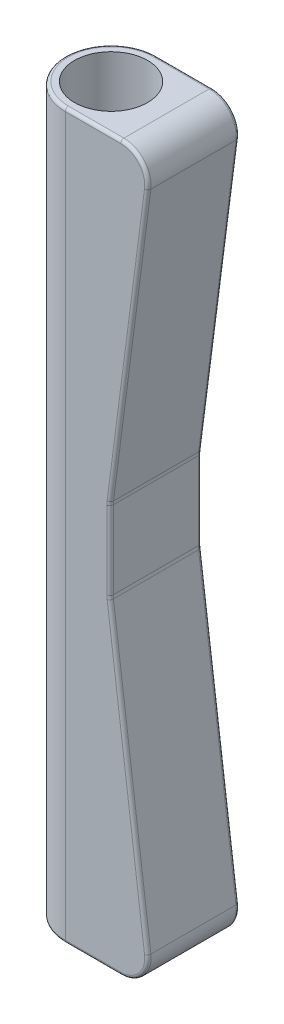
ISO-10303-21;
HEADER;
FILE_DESCRIPTION(('STEP AP214'),'2;1');
FILE_NAME('part.step','',(''),(''),'','','');
FILE_SCHEMA(('AUTOMOTIVE_DESIGN { 1 0 10303 214 1 1 1 1 }'));
ENDSEC;
DATA;
#1=APPLICATION_CONTEXT('core data for automotive mechanical design processes');
#2=APPLICATION_PROTOCOL_DEFINITION('international standard','automotive_design',2000,#1);
#3=PRODUCT_CONTEXT('',#1,'mechanical');
#4=PRODUCT('Part','Part','',(#3));
#5=PRODUCT_RELATED_PRODUCT_CATEGORY('part','',(#4));
#6=PRODUCT_DEFINITION_FORMATION('','',#4);
#7=PRODUCT_DEFINITION_CONTEXT('part definition',#1,'design');
#8=PRODUCT_DEFINITION('design','',#6,#7);
#9=PRODUCT_DEFINITION_SHAPE('','',#8);
#10=(LENGTH_UNIT() NAMED_UNIT(*) SI_UNIT(.MILLI.,.METRE.));
#11=(NAMED_UNIT(*) PLANE_ANGLE_UNIT() SI_UNIT($,.RADIAN.));
#12=(NAMED_UNIT(*) SI_UNIT($,.STERADIAN.) SOLID_ANGLE_UNIT());
#13=UNCERTAINTY_MEASURE_WITH_UNIT(LENGTH_MEASURE(1.E-05),#10,'distance_accuracy_value','');
#14=(GEOMETRIC_REPRESENTATION_CONTEXT(3) GLOBAL_UNCERTAINTY_ASSIGNED_CONTEXT((#13)) GLOBAL_UNIT_ASSIGNED_CONTEXT((#10,
#11,#12)) REPRESENTATION_CONTEXT('',''));
#15=CARTESIAN_POINT('',(0.,0.,0.));
#16=DIRECTION('',(0.,0.,1.));
#17=DIRECTION('',(1.,0.,0.));
#18=AXIS2_PLACEMENT_3D('',#15,#16,#17);
#19=CARTESIAN_POINT('',(0.,226.06,0.));
#20=DIRECTION('',(0.,-1.,0.));
#21=DIRECTION('',(0.,0.,-1.));
#22=AXIS2_PLACEMENT_3D('',#19,#20,#21);
#23=CYLINDRICAL_SURFACE('',#22,14.2875);
#24=DIRECTION('',(0.,1.,0.));
#25=VECTOR('',#24,1.);
#26=CARTESIAN_POINT('',(0.,0.,14.2875));
#27=LINE('',#26,#25);
#28=CARTESIAN_POINT('',(0.,1.,14.2875));
#29=VERTEX_POINT('',#28);
#30=CARTESIAN_POINT('',(0.,225.06,14.2875));
#31=VERTEX_POINT('',#30);
#32=EDGE_CURVE('E181',#29,#31,#27,.T.);
#33=ORIENTED_EDGE('',*,*,#32,.T.);
#34=CARTESIAN_POINT('',(0.,225.06,0.));
#35=DIRECTION('',(0.,1.,0.));
#36=DIRECTION('',(0.,0.,1.));
#37=AXIS2_PLACEMENT_3D('',#34,#35,#36);
#38=CIRCLE('',#37,14.2875);
#39=CARTESIAN_POINT('',(0.,225.06,-14.2875));
#40=VERTEX_POINT('',#39);
#41=EDGE_CURVE('E190',#31,#40,#38,.F.);
#42=ORIENTED_EDGE('',*,*,#41,.T.);
#43=DIRECTION('',(0.,1.,0.));
#44=VECTOR('',#43,1.);
#45=CARTESIAN_POINT('',(0.,0.,-14.2875));
#46=LINE('',#45,#44);
#47=CARTESIAN_POINT('',(0.,0.999999999999996,-14.2875));
#48=VERTEX_POINT('',#47);
#49=EDGE_CURVE('E184',#48,#40,#46,.T.);
#50=ORIENTED_EDGE('',*,*,#49,.F.);
#51=CARTESIAN_POINT('',(0.,1.,0.));
#52=DIRECTION('',(0.,1.,0.));
#53=DIRECTION('',(0.,0.,1.));
#54=AXIS2_PLACEMENT_3D('',#51,#52,#53);
#55=CIRCLE('',#54,14.2875);
#56=EDGE_CURVE('E179',#48,#29,#55,.T.);
#57=ORIENTED_EDGE('',*,*,#56,.T.);
#58=EDGE_LOOP('',(#33,#42,#50,#57));
#59=FACE_BOUND('',#58,.T.);
#60=ADVANCED_FACE('F41',(#59),#23,.T.);
#61=CARTESIAN_POINT('',(0.,226.06,0.));
#62=DIRECTION('',(0.,1.,0.));
#63=DIRECTION('',(0.,0.,1.));
#64=AXIS2_PLACEMENT_3D('',#61,#62,#63);
#65=PLANE('',#64);
#66=CARTESIAN_POINT('',(0.,226.06,0.));
#67=DIRECTION('',(0.,1.,0.));
#68=DIRECTION('',(0.,0.,1.));
#69=AXIS2_PLACEMENT_3D('',#66,#67,#68);
#70=CIRCLE('',#69,13.2875);
#71=CARTESIAN_POINT('',(0.,226.06,-13.2875));
#72=VERTEX_POINT('',#71);
#73=CARTESIAN_POINT('',(0.,226.06,13.2875));
#74=VERTEX_POINT('',#73);
#75=EDGE_CURVE('E239',#72,#74,#70,.T.);
#76=ORIENTED_EDGE('',*,*,#75,.T.);
#77=DIRECTION('',(1.,0.,0.));
#78=VECTOR('',#77,1.);
#79=CARTESIAN_POINT('',(0.,226.06,13.2875));
#80=LINE('',#79,#78);
#81=CARTESIAN_POINT('',(17.3150782146866,226.06,13.2875));
#82=VERTEX_POINT('',#81);
#83=EDGE_CURVE('E191',#74,#82,#80,.T.);
#84=ORIENTED_EDGE('',*,*,#83,.T.);
#85=DIRECTION('',(0.,0.,-1.));
#86=VECTOR('',#85,1.);
#87=CARTESIAN_POINT('',(17.3150782146866,226.06,-14.2875));
#88=LINE('',#87,#86);
#89=CARTESIAN_POINT('',(17.3150782146866,226.06,-13.2875));
#90=VERTEX_POINT('',#89);
#91=EDGE_CURVE('E404',#82,#90,#88,.T.);
#92=ORIENTED_EDGE('',*,*,#91,.T.);
#93=DIRECTION('',(-1.,0.,0.));
#94=VECTOR('',#93,1.);
#95=CARTESIAN_POINT('',(0.,226.06,-13.2875));
#96=LINE('',#95,#94);
#97=EDGE_CURVE('E236',#90,#72,#96,.T.);
#98=ORIENTED_EDGE('',*,*,#97,.T.);
#99=EDGE_LOOP('',(#76,#84,#92,#98));
#100=FACE_BOUND('',#99,.T.);
#101=CARTESIAN_POINT('',(0.,226.06,0.));
#102=DIRECTION('',(0.,1.,0.));
#103=DIRECTION('',(0.,0.,1.));
#104=AXIS2_PLACEMENT_3D('',#101,#102,#103);
#105=CIRCLE('',#104,11.4125);
#106=CARTESIAN_POINT('',(0.,226.06,11.4125));
#107=VERTEX_POINT('',#106);
#108=EDGE_CURVE('E390',#107,#107,#105,.T.);
#109=ORIENTED_EDGE('',*,*,#108,.F.);
#110=EDGE_LOOP('',(#109));
#111=FACE_BOUND('',#110,.T.);
#112=ADVANCED_FACE('F532',(#100,#111),#65,.T.);
#113=CARTESIAN_POINT('',(0.,0.,0.));
#114=DIRECTION('',(0.,1.,0.));
#115=DIRECTION('',(0.,0.,1.));
#116=AXIS2_PLACEMENT_3D('',#113,#114,#115);
#117=PLANE('',#116);
#118=CARTESIAN_POINT('',(0.,0.,0.));
#119=DIRECTION('',(0.,1.,0.));
#120=DIRECTION('',(0.,0.,1.));
#121=AXIS2_PLACEMENT_3D('',#118,#119,#120);
#122=CIRCLE('',#121,13.2875);
#123=CARTESIAN_POINT('',(0.,0.,13.2875));
#124=VERTEX_POINT('',#123);
#125=CARTESIAN_POINT('',(0.,0.,-13.2875));
#126=VERTEX_POINT('',#125);
#127=EDGE_CURVE('E51',#124,#126,#122,.F.);
#128=ORIENTED_EDGE('',*,*,#127,.T.);
#129=DIRECTION('',(-1.,0.,0.));
#130=VECTOR('',#129,1.);
#131=CARTESIAN_POINT('',(17.3150782146866,0.,-13.2875));
#132=LINE('',#131,#130);
#133=CARTESIAN_POINT('',(17.3150782146866,0.,-13.2875));
#134=VERTEX_POINT('',#133);
#135=EDGE_CURVE('E11',#126,#134,#132,.F.);
#136=ORIENTED_EDGE('',*,*,#135,.T.);
#137=DIRECTION('',(0.,0.,-1.));
#138=VECTOR('',#137,1.);
#139=CARTESIAN_POINT('',(17.3150782146866,0.,0.));
#140=LINE('',#139,#138);
#141=CARTESIAN_POINT('',(17.3150782146866,0.,13.2875));
#142=VERTEX_POINT('',#141);
#143=EDGE_CURVE('E401',#134,#142,#140,.F.);
#144=ORIENTED_EDGE('',*,*,#143,.T.);
#145=DIRECTION('',(1.,0.,0.));
#146=VECTOR('',#145,1.);
#147=CARTESIAN_POINT('',(0.,0.,13.2875));
#148=LINE('',#147,#146);
#149=EDGE_CURVE('E62',#142,#124,#148,.F.);
#150=ORIENTED_EDGE('',*,*,#149,.T.);
#151=EDGE_LOOP('',(#128,#136,#144,#150));
#152=FACE_BOUND('',#151,.T.);
#153=CARTESIAN_POINT('',(0.,0.,0.));
#154=DIRECTION('',(0.,1.,0.));
#155=DIRECTION('',(0.,0.,1.));
#156=AXIS2_PLACEMENT_3D('',#153,#154,#155);
#157=CIRCLE('',#156,11.4125);
#158=CARTESIAN_POINT('',(0.,0.,11.4125));
#159=VERTEX_POINT('',#158);
#160=EDGE_CURVE('E202',#159,#159,#157,.T.);
#161=ORIENTED_EDGE('',*,*,#160,.T.);
#162=EDGE_LOOP('',(#161));
#163=FACE_BOUND('',#162,.T.);
#164=ADVANCED_FACE('F515',(#152,#163),#117,.F.);
#165=CARTESIAN_POINT('',(0.,226.06,0.));
#166=DIRECTION('',(0.,-1.,0.));
#167=DIRECTION('',(0.,0.,-1.));
#168=AXIS2_PLACEMENT_3D('',#165,#166,#167);
#169=CYLINDRICAL_SURFACE('',#168,11.4125);
#170=ORIENTED_EDGE('',*,*,#108,.T.);
#171=EDGE_LOOP('',(#170));
#172=FACE_BOUND('',#171,.T.);
#173=ORIENTED_EDGE('',*,*,#160,.F.);
#174=EDGE_LOOP('',(#173));
#175=FACE_BOUND('',#174,.T.);
#176=ADVANCED_FACE('F768',(#172,#175),#169,.F.);
#177=CARTESIAN_POINT('',(14.2875,0.,14.2875));
#178=DIRECTION('',(0.,0.,1.));
#179=DIRECTION('',(1.,0.,0.));
#180=AXIS2_PLACEMENT_3D('',#177,#178,#179);
#181=PLANE('',#180);
#182=CARTESIAN_POINT('',(17.3150782146866,217.56,14.2875));
#183=DIRECTION('',(0.,0.,1.));
#184=DIRECTION('',(1.,0.,0.));
#185=AXIS2_PLACEMENT_3D('',#182,#183,#184);
#186=CIRCLE('',#185,7.5);
#187=CARTESIAN_POINT('',(24.7529012591629,216.596263335212,14.2875));
#188=VERTEX_POINT('',#187);
#189=CARTESIAN_POINT('',(17.3150782146866,225.06,14.2875));
#190=VERTEX_POINT('',#189);
#191=EDGE_CURVE('E217',#188,#190,#186,.T.);
#192=ORIENTED_EDGE('',*,*,#191,.T.);
#193=DIRECTION('',(1.,0.,0.));
#194=VECTOR('',#193,1.);
#195=CARTESIAN_POINT('',(14.2875,225.06,14.2875));
#196=LINE('',#195,#194);
#197=EDGE_CURVE('E200',#190,#31,#196,.F.);
#198=ORIENTED_EDGE('',*,*,#197,.T.);
#199=ORIENTED_EDGE('',*,*,#32,.F.);
#200=DIRECTION('',(1.,0.,0.));
#201=VECTOR('',#200,1.);
#202=CARTESIAN_POINT('',(17.3150782146866,1.,14.2875));
#203=LINE('',#202,#201);
#204=CARTESIAN_POINT('',(17.3150782146866,1.,14.2875));
#205=VERTEX_POINT('',#204);
#206=EDGE_CURVE('E197',#29,#205,#203,.T.);
#207=ORIENTED_EDGE('',*,*,#206,.T.);
#208=CARTESIAN_POINT('',(17.3150782146866,8.5,14.2875));
#209=DIRECTION('',(0.,0.,1.));
#210=DIRECTION('',(1.,0.,0.));
#211=AXIS2_PLACEMENT_3D('',#208,#209,#210);
#212=CIRCLE('',#211,7.5);
#213=CARTESIAN_POINT('',(24.7529012591629,9.46373666478812,14.2875));
#214=VERTEX_POINT('',#213);
#215=EDGE_CURVE('E218',#205,#214,#212,.T.);
#216=ORIENTED_EDGE('',*,*,#215,.T.);
#217=DIRECTION('',(0.128498221971749,-0.99170973926351,0.));
#218=VECTOR('',#217,1.);
#219=CARTESIAN_POINT('',(13.0662574769966,99.6576574851528,14.2875));
#220=LINE('',#219,#218);
#221=CARTESIAN_POINT('',(13.0662574769967,99.6576574851527,14.2875));
#222=VERTEX_POINT('',#221);
#223=EDGE_CURVE('E223',#214,#222,#220,.F.);
#224=ORIENTED_EDGE('',*,*,#223,.T.);
#225=CARTESIAN_POINT('',(22.4875,100.878390593884,14.2875));
#226=DIRECTION('',(0.,0.,1.));
#227=DIRECTION('',(1.,0.,0.));
#228=AXIS2_PLACEMENT_3D('',#225,#226,#227);
#229=CIRCLE('',#228,9.5);
#230=CARTESIAN_POINT('',(12.9875,100.878390593884,14.2875));
#231=VERTEX_POINT('',#230);
#232=EDGE_CURVE('E437',#222,#231,#229,.F.);
#233=ORIENTED_EDGE('',*,*,#232,.T.);
#234=DIRECTION('',(0.,-1.,0.));
#235=VECTOR('',#234,1.);
#236=CARTESIAN_POINT('',(12.9875,125.181609406116,14.2875));
#237=LINE('',#236,#235);
#238=CARTESIAN_POINT('',(12.9875,125.181609406116,14.2875));
#239=VERTEX_POINT('',#238);
#240=EDGE_CURVE('E434',#231,#239,#237,.F.);
#241=ORIENTED_EDGE('',*,*,#240,.T.);
#242=CARTESIAN_POINT('',(22.4875,125.181609406116,14.2875));
#243=DIRECTION('',(0.,0.,1.));
#244=DIRECTION('',(1.,0.,0.));
#245=AXIS2_PLACEMENT_3D('',#242,#243,#244);
#246=CIRCLE('',#245,9.5);
#247=CARTESIAN_POINT('',(13.0662574769967,126.402342514847,14.2875));
#248=VERTEX_POINT('',#247);
#249=EDGE_CURVE('E431',#239,#248,#246,.F.);
#250=ORIENTED_EDGE('',*,*,#249,.T.);
#251=DIRECTION('',(-0.12849822197175,-0.99170973926351,0.));
#252=VECTOR('',#251,1.);
#253=CARTESIAN_POINT('',(24.7529012591629,216.596263335212,14.2875));
#254=LINE('',#253,#252);
#255=EDGE_CURVE('E428',#248,#188,#254,.F.);
#256=ORIENTED_EDGE('',*,*,#255,.T.);
#257=EDGE_LOOP('',(#192,#198,#199,#207,#216,#224,#233,#241,#250,#256));
#258=FACE_BOUND('',#257,.T.);
#259=ADVANCED_FACE('F195',(#258),#181,.T.);
#260=CARTESIAN_POINT('',(14.2875,0.,-14.2875));
#261=DIRECTION('',(0.,0.,-1.));
#262=DIRECTION('',(-1.,0.,0.));
#263=AXIS2_PLACEMENT_3D('',#260,#261,#262);
#264=PLANE('',#263);
#265=ORIENTED_EDGE('',*,*,#49,.T.);
#266=DIRECTION('',(-1.,0.,0.));
#267=VECTOR('',#266,1.);
#268=CARTESIAN_POINT('',(14.2875,225.06,-14.2875));
#269=LINE('',#268,#267);
#270=CARTESIAN_POINT('',(17.3150782146866,225.06,-14.2875));
#271=VERTEX_POINT('',#270);
#272=EDGE_CURVE('E270',#40,#271,#269,.F.);
#273=ORIENTED_EDGE('',*,*,#272,.T.);
#274=CARTESIAN_POINT('',(17.3150782146866,217.56,-14.2875));
#275=DIRECTION('',(0.,0.,-1.));
#276=DIRECTION('',(-1.,0.,0.));
#277=AXIS2_PLACEMENT_3D('',#274,#275,#276);
#278=CIRCLE('',#277,7.5);
#279=CARTESIAN_POINT('',(24.7529012591629,216.596263335212,-14.2875));
#280=VERTEX_POINT('',#279);
#281=EDGE_CURVE('E267',#271,#280,#278,.T.);
#282=ORIENTED_EDGE('',*,*,#281,.T.);
#283=DIRECTION('',(-0.12849822197175,-0.99170973926351,0.));
#284=VECTOR('',#283,1.);
#285=CARTESIAN_POINT('',(13.0662574769967,126.402342514847,-14.2875));
#286=LINE('',#285,#284);
#287=CARTESIAN_POINT('',(13.0662574769967,126.402342514847,-14.2875));
#288=VERTEX_POINT('',#287);
#289=EDGE_CURVE('E264',#280,#288,#286,.T.);
#290=ORIENTED_EDGE('',*,*,#289,.T.);
#291=CARTESIAN_POINT('',(22.4875,125.181609406116,-14.2875));
#292=DIRECTION('',(0.,0.,-1.));
#293=DIRECTION('',(-1.,0.,0.));
#294=AXIS2_PLACEMENT_3D('',#291,#292,#293);
#295=CIRCLE('',#294,9.5);
#296=CARTESIAN_POINT('',(12.9875,125.181609406116,-14.2875));
#297=VERTEX_POINT('',#296);
#298=EDGE_CURVE('E261',#288,#297,#295,.F.);
#299=ORIENTED_EDGE('',*,*,#298,.T.);
#300=DIRECTION('',(0.,-1.,0.));
#301=VECTOR('',#300,1.);
#302=CARTESIAN_POINT('',(12.9875,100.878390593884,-14.2875));
#303=LINE('',#302,#301);
#304=CARTESIAN_POINT('',(12.9875,100.878390593884,-14.2875));
#305=VERTEX_POINT('',#304);
#306=EDGE_CURVE('E258',#297,#305,#303,.T.);
#307=ORIENTED_EDGE('',*,*,#306,.T.);
#308=CARTESIAN_POINT('',(22.4875,100.878390593884,-14.2875));
#309=DIRECTION('',(0.,0.,-1.));
#310=DIRECTION('',(-1.,0.,0.));
#311=AXIS2_PLACEMENT_3D('',#308,#309,#310);
#312=CIRCLE('',#311,9.5);
#313=CARTESIAN_POINT('',(13.0662574769966,99.6576574851527,-14.2875));
#314=VERTEX_POINT('',#313);
#315=EDGE_CURVE('E255',#305,#314,#312,.F.);
#316=ORIENTED_EDGE('',*,*,#315,.T.);
#317=DIRECTION('',(0.128498221971749,-0.99170973926351,0.));
#318=VECTOR('',#317,1.);
#319=CARTESIAN_POINT('',(24.7529012591629,9.46373666478812,-14.2875));
#320=LINE('',#319,#318);
#321=CARTESIAN_POINT('',(24.7529012591629,9.46373666478812,-14.2875));
#322=VERTEX_POINT('',#321);
#323=EDGE_CURVE('E252',#314,#322,#320,.T.);
#324=ORIENTED_EDGE('',*,*,#323,.T.);
#325=CARTESIAN_POINT('',(17.3150782146866,8.5,-14.2875));
#326=DIRECTION('',(0.,0.,-1.));
#327=DIRECTION('',(-1.,0.,0.));
#328=AXIS2_PLACEMENT_3D('',#325,#326,#327);
#329=CIRCLE('',#328,7.5);
#330=CARTESIAN_POINT('',(17.3150782146866,1.,-14.2875));
#331=VERTEX_POINT('',#330);
#332=EDGE_CURVE('E249',#322,#331,#329,.T.);
#333=ORIENTED_EDGE('',*,*,#332,.T.);
#334=DIRECTION('',(-1.,0.,0.));
#335=VECTOR('',#334,1.);
#336=CARTESIAN_POINT('',(0.,1.,-14.2875));
#337=LINE('',#336,#335);
#338=EDGE_CURVE('E246',#331,#48,#337,.T.);
#339=ORIENTED_EDGE('',*,*,#338,.T.);
#340=EDGE_LOOP('',(#265,#273,#282,#290,#299,#307,#316,#324,#333,#339));
#341=FACE_BOUND('',#340,.T.);
#342=ADVANCED_FACE('F484',(#341),#264,.T.);
#343=CARTESIAN_POINT('',(-2.26560202610545,0.29355951698765,-14.2875));
#344=DIRECTION('',(-0.99170973926351,0.12849822197175,0.));
#345=DIRECTION('',(-0.12849822197175,-0.99170973926351,0.));
#346=AXIS2_PLACEMENT_3D('',#343,#344,#345);
#347=PLANE('',#346);
#348=DIRECTION('',(0.,0.,1.));
#349=VECTOR('',#348,1.);
#350=CARTESIAN_POINT('',(14.0579672162602,126.273844292876,-14.2875));
#351=LINE('',#350,#349);
#352=CARTESIAN_POINT('',(14.0579672162602,126.273844292876,13.2875));
#353=VERTEX_POINT('',#352);
#354=CARTESIAN_POINT('',(14.0579672162602,126.273844292876,-13.2875));
#355=VERTEX_POINT('',#354);
#356=EDGE_CURVE('E424',#353,#355,#351,.F.);
#357=ORIENTED_EDGE('',*,*,#356,.T.);
#358=DIRECTION('',(-0.12849822197175,-0.99170973926351,0.));
#359=VECTOR('',#358,1.);
#360=CARTESIAN_POINT('',(25.7446109984264,216.46776511324,-13.2875));
#361=LINE('',#360,#359);
#362=CARTESIAN_POINT('',(25.7446109984264,216.46776511324,-13.2875));
#363=VERTEX_POINT('',#362);
#364=EDGE_CURVE('E276',#355,#363,#361,.F.);
#365=ORIENTED_EDGE('',*,*,#364,.T.);
#366=DIRECTION('',(0.,0.,-1.));
#367=VECTOR('',#366,1.);
#368=CARTESIAN_POINT('',(25.7446109984264,216.46776511324,14.2875));
#369=LINE('',#368,#367);
#370=CARTESIAN_POINT('',(25.7446109984264,216.46776511324,13.2875));
#371=VERTEX_POINT('',#370);
#372=EDGE_CURVE('E408',#363,#371,#369,.F.);
#373=ORIENTED_EDGE('',*,*,#372,.T.);
#374=DIRECTION('',(-0.12849822197175,-0.99170973926351,0.));
#375=VECTOR('',#374,1.);
#376=CARTESIAN_POINT('',(14.0579672162602,126.273844292876,13.2875));
#377=LINE('',#376,#375);
#378=EDGE_CURVE('E273',#371,#353,#377,.T.);
#379=ORIENTED_EDGE('',*,*,#378,.T.);
#380=EDGE_LOOP('',(#357,#365,#373,#379));
#381=FACE_BOUND('',#380,.T.);
#382=ADVANCED_FACE('F741',(#381),#347,.F.);
#383=CARTESIAN_POINT('',(26.5418879850658,3.43909641987297,-14.2875));
#384=DIRECTION('',(-0.99170973926351,-0.128498221971749,0.));
#385=DIRECTION('',(0.128498221971749,-0.99170973926351,0.));
#386=AXIS2_PLACEMENT_3D('',#383,#384,#385);
#387=PLANE('',#386);
#388=DIRECTION('',(0.,0.,-1.));
#389=VECTOR('',#388,1.);
#390=CARTESIAN_POINT('',(25.7446109984264,9.59223488675987,-14.2875));
#391=LINE('',#390,#389);
#392=CARTESIAN_POINT('',(25.7446109984264,9.59223488675987,13.2875));
#393=VERTEX_POINT('',#392);
#394=CARTESIAN_POINT('',(25.7446109984264,9.59223488675987,-13.2875));
#395=VERTEX_POINT('',#394);
#396=EDGE_CURVE('E394',#393,#395,#391,.T.);
#397=ORIENTED_EDGE('',*,*,#396,.T.);
#398=DIRECTION('',(0.128498221971749,-0.99170973926351,0.));
#399=VECTOR('',#398,1.);
#400=CARTESIAN_POINT('',(14.0579672162602,99.7861557071245,-13.2875));
#401=LINE('',#400,#399);
#402=CARTESIAN_POINT('',(14.0579672162602,99.7861557071245,-13.2875));
#403=VERTEX_POINT('',#402);
#404=EDGE_CURVE('E300',#395,#403,#401,.F.);
#405=ORIENTED_EDGE('',*,*,#404,.T.);
#406=DIRECTION('',(0.,0.,1.));
#407=VECTOR('',#406,1.);
#408=CARTESIAN_POINT('',(14.0579672162602,99.7861557071245,14.2875));
#409=LINE('',#408,#407);
#410=CARTESIAN_POINT('',(14.0579672162602,99.7861557071245,13.2875));
#411=VERTEX_POINT('',#410);
#412=EDGE_CURVE('E412',#403,#411,#409,.T.);
#413=ORIENTED_EDGE('',*,*,#412,.T.);
#414=DIRECTION('',(0.128498221971749,-0.99170973926351,0.));
#415=VECTOR('',#414,1.);
#416=CARTESIAN_POINT('',(25.7446109984264,9.59223488675987,13.2875));
#417=LINE('',#416,#415);
#418=EDGE_CURVE('E297',#411,#393,#417,.T.);
#419=ORIENTED_EDGE('',*,*,#418,.T.);
#420=EDGE_LOOP('',(#397,#405,#413,#419));
#421=FACE_BOUND('',#420,.T.);
#422=ADVANCED_FACE('F732',(#421),#387,.F.);
#423=CARTESIAN_POINT('',(13.9875,0.,-14.2875));
#424=DIRECTION('',(-1.,0.,0.));
#425=DIRECTION('',(0.,-1.,0.));
#426=AXIS2_PLACEMENT_3D('',#423,#424,#425);
#427=PLANE('',#426);
#428=DIRECTION('',(0.,0.,1.));
#429=VECTOR('',#428,1.);
#430=CARTESIAN_POINT('',(13.9875,100.878390593884,-14.2875));
#431=LINE('',#430,#429);
#432=CARTESIAN_POINT('',(13.9875,100.878390593884,13.2875));
#433=VERTEX_POINT('',#432);
#434=CARTESIAN_POINT('',(13.9875,100.878390593884,-13.2875));
#435=VERTEX_POINT('',#434);
#436=EDGE_CURVE('E420',#433,#435,#431,.F.);
#437=ORIENTED_EDGE('',*,*,#436,.T.);
#438=DIRECTION('',(0.,-1.,0.));
#439=VECTOR('',#438,1.);
#440=CARTESIAN_POINT('',(13.9875,125.181609406116,-13.2875));
#441=LINE('',#440,#439);
#442=CARTESIAN_POINT('',(13.9875,125.181609406116,-13.2875));
#443=VERTEX_POINT('',#442);
#444=EDGE_CURVE('E288',#435,#443,#441,.F.);
#445=ORIENTED_EDGE('',*,*,#444,.T.);
#446=DIRECTION('',(0.,0.,1.));
#447=VECTOR('',#446,1.);
#448=CARTESIAN_POINT('',(13.9875,125.181609406116,14.2875));
#449=LINE('',#448,#447);
#450=CARTESIAN_POINT('',(13.9875,125.181609406116,13.2875));
#451=VERTEX_POINT('',#450);
#452=EDGE_CURVE('E416',#443,#451,#449,.T.);
#453=ORIENTED_EDGE('',*,*,#452,.T.);
#454=DIRECTION('',(0.,-1.,0.));
#455=VECTOR('',#454,1.);
#456=CARTESIAN_POINT('',(13.9875,100.878390593884,13.2875));
#457=LINE('',#456,#455);
#458=EDGE_CURVE('E285',#451,#433,#457,.T.);
#459=ORIENTED_EDGE('',*,*,#458,.T.);
#460=EDGE_LOOP('',(#437,#445,#453,#459));
#461=FACE_BOUND('',#460,.T.);
#462=ADVANCED_FACE('F544',(#461),#427,.F.);
#463=CARTESIAN_POINT('',(17.3150782146866,8.5,-14.2875));
#464=DIRECTION('',(0.,0.,-1.));
#465=DIRECTION('',(-1.,0.,0.));
#466=AXIS2_PLACEMENT_3D('',#463,#464,#465);
#467=CYLINDRICAL_SURFACE('',#466,8.5);
#468=ORIENTED_EDGE('',*,*,#143,.F.);
#469=CARTESIAN_POINT('',(17.3150782146866,8.5,-13.2875));
#470=DIRECTION('',(0.,0.,-1.));
#471=DIRECTION('',(-1.,0.,0.));
#472=AXIS2_PLACEMENT_3D('',#469,#470,#471);
#473=CIRCLE('',#472,8.5);
#474=EDGE_CURVE('E306',#134,#395,#473,.F.);
#475=ORIENTED_EDGE('',*,*,#474,.T.);
#476=ORIENTED_EDGE('',*,*,#396,.F.);
#477=CARTESIAN_POINT('',(17.3150782146866,8.5,13.2875));
#478=DIRECTION('',(0.,0.,1.));
#479=DIRECTION('',(1.,0.,0.));
#480=AXIS2_PLACEMENT_3D('',#477,#478,#479);
#481=CIRCLE('',#480,8.5);
#482=EDGE_CURVE('E303',#393,#142,#481,.F.);
#483=ORIENTED_EDGE('',*,*,#482,.T.);
#484=EDGE_LOOP('',(#468,#475,#476,#483));
#485=FACE_BOUND('',#484,.T.);
#486=ADVANCED_FACE('F518',(#485),#467,.T.);
#487=CARTESIAN_POINT('',(17.3150782146866,217.56,0.));
#488=DIRECTION('',(0.,0.,1.));
#489=DIRECTION('',(1.,0.,0.));
#490=AXIS2_PLACEMENT_3D('',#487,#488,#489);
#491=CYLINDRICAL_SURFACE('',#490,8.5);
#492=ORIENTED_EDGE('',*,*,#91,.F.);
#493=CARTESIAN_POINT('',(17.3150782146866,217.56,13.2875));
#494=DIRECTION('',(0.,0.,1.));
#495=DIRECTION('',(1.,0.,0.));
#496=AXIS2_PLACEMENT_3D('',#493,#494,#495);
#497=CIRCLE('',#496,8.5);
#498=EDGE_CURVE('E232',#82,#371,#497,.F.);
#499=ORIENTED_EDGE('',*,*,#498,.T.);
#500=ORIENTED_EDGE('',*,*,#372,.F.);
#501=CARTESIAN_POINT('',(17.3150782146866,217.56,-13.2875));
#502=DIRECTION('',(0.,0.,-1.));
#503=DIRECTION('',(-1.,0.,0.));
#504=AXIS2_PLACEMENT_3D('',#501,#502,#503);
#505=CIRCLE('',#504,8.5);
#506=EDGE_CURVE('E229',#363,#90,#505,.F.);
#507=ORIENTED_EDGE('',*,*,#506,.T.);
#508=EDGE_LOOP('',(#492,#499,#500,#507));
#509=FACE_BOUND('',#508,.T.);
#510=ADVANCED_FACE('F543',(#509),#491,.T.);
#511=CARTESIAN_POINT('',(22.4875,100.878390593884,-14.2875));
#512=DIRECTION('',(0.,0.,-1.));
#513=DIRECTION('',(-1.,0.,0.));
#514=AXIS2_PLACEMENT_3D('',#511,#512,#513);
#515=CYLINDRICAL_SURFACE('',#514,8.5);
#516=ORIENTED_EDGE('',*,*,#412,.F.);
#517=CARTESIAN_POINT('',(22.4875,100.878390593884,-13.2875));
#518=DIRECTION('',(0.,0.,-1.));
#519=DIRECTION('',(-1.,0.,0.));
#520=AXIS2_PLACEMENT_3D('',#517,#518,#519);
#521=CIRCLE('',#520,8.5);
#522=EDGE_CURVE('E294',#403,#435,#521,.T.);
#523=ORIENTED_EDGE('',*,*,#522,.T.);
#524=ORIENTED_EDGE('',*,*,#436,.F.);
#525=CARTESIAN_POINT('',(22.4875,100.878390593884,13.2875));
#526=DIRECTION('',(0.,0.,1.));
#527=DIRECTION('',(1.,0.,0.));
#528=AXIS2_PLACEMENT_3D('',#525,#526,#527);
#529=CIRCLE('',#528,8.5);
#530=EDGE_CURVE('E291',#433,#411,#529,.T.);
#531=ORIENTED_EDGE('',*,*,#530,.T.);
#532=EDGE_LOOP('',(#516,#523,#524,#531));
#533=FACE_BOUND('',#532,.T.);
#534=ADVANCED_FACE('F547',(#533),#515,.F.);
#535=CARTESIAN_POINT('',(22.4875,125.181609406116,-14.2875));
#536=DIRECTION('',(0.,0.,-1.));
#537=DIRECTION('',(-1.,0.,0.));
#538=AXIS2_PLACEMENT_3D('',#535,#536,#537);
#539=CYLINDRICAL_SURFACE('',#538,8.5);
#540=ORIENTED_EDGE('',*,*,#452,.F.);
#541=CARTESIAN_POINT('',(22.4875,125.181609406116,-13.2875));
#542=DIRECTION('',(0.,0.,-1.));
#543=DIRECTION('',(-1.,0.,0.));
#544=AXIS2_PLACEMENT_3D('',#541,#542,#543);
#545=CIRCLE('',#544,8.5);
#546=EDGE_CURVE('E282',#443,#355,#545,.T.);
#547=ORIENTED_EDGE('',*,*,#546,.T.);
#548=ORIENTED_EDGE('',*,*,#356,.F.);
#549=CARTESIAN_POINT('',(22.4875,125.181609406116,13.2875));
#550=DIRECTION('',(0.,0.,1.));
#551=DIRECTION('',(1.,0.,0.));
#552=AXIS2_PLACEMENT_3D('',#549,#550,#551);
#553=CIRCLE('',#552,8.5);
#554=EDGE_CURVE('E279',#353,#451,#553,.T.);
#555=ORIENTED_EDGE('',*,*,#554,.T.);
#556=EDGE_LOOP('',(#540,#547,#548,#555));
#557=FACE_BOUND('',#556,.T.);
#558=ADVANCED_FACE('F551',(#557),#539,.F.);
#559=CARTESIAN_POINT('',(17.3150782146866,8.5,-13.2875));
#560=DIRECTION('',(0.,0.,-1.));
#561=DIRECTION('',(-1.,0.,0.));
#562=AXIS2_PLACEMENT_3D('',#559,#560,#561);
#563=TOROIDAL_SURFACE('',#562,7.5,1.);
#564=CARTESIAN_POINT('',(24.7529012591629,9.46373666478812,-13.2875));
#565=DIRECTION('',(-0.128498221971749,0.99170973926351,0.));
#566=DIRECTION('',(-0.99170973926351,-0.128498221971749,0.));
#567=AXIS2_PLACEMENT_3D('',#564,#565,#566);
#568=CIRCLE('',#567,1.);
#569=EDGE_CURVE('E373',#395,#322,#568,.T.);
#570=ORIENTED_EDGE('',*,*,#569,.F.);
#571=ORIENTED_EDGE('',*,*,#474,.F.);
#572=CARTESIAN_POINT('',(17.3150782146866,1.,-13.2875));
#573=DIRECTION('',(-1.,0.,0.));
#574=DIRECTION('',(0.,0.,1.));
#575=AXIS2_PLACEMENT_3D('',#572,#573,#574);
#576=CIRCLE('',#575,1.);
#577=EDGE_CURVE('E45',#331,#134,#576,.T.);
#578=ORIENTED_EDGE('',*,*,#577,.F.);
#579=ORIENTED_EDGE('',*,*,#332,.F.);
#580=EDGE_LOOP('',(#570,#571,#578,#579));
#581=FACE_BOUND('',#580,.T.);
#582=ADVANCED_FACE('F43',(#581),#563,.T.);
#583=CARTESIAN_POINT('',(14.2875,1.,-13.2875));
#584=DIRECTION('',(1.,0.,0.));
#585=DIRECTION('',(0.,0.,-1.));
#586=AXIS2_PLACEMENT_3D('',#583,#584,#585);
#587=CYLINDRICAL_SURFACE('',#586,1.);
#588=ORIENTED_EDGE('',*,*,#577,.T.);
#589=ORIENTED_EDGE('',*,*,#135,.F.);
#590=CARTESIAN_POINT('',(0.,1.,-13.2875));
#591=DIRECTION('',(-1.,0.,0.));
#592=DIRECTION('',(0.,0.,1.));
#593=AXIS2_PLACEMENT_3D('',#590,#591,#592);
#594=CIRCLE('',#593,1.);
#595=EDGE_CURVE('E371',#48,#126,#594,.T.);
#596=ORIENTED_EDGE('',*,*,#595,.F.);
#597=ORIENTED_EDGE('',*,*,#338,.F.);
#598=EDGE_LOOP('',(#588,#589,#596,#597));
#599=FACE_BOUND('',#598,.T.);
#600=ADVANCED_FACE('F513',(#599),#587,.T.);
#601=CARTESIAN_POINT('',(25.7860904890027,1.48990009326259,-13.2875));
#602=DIRECTION('',(-0.128498221971749,0.99170973926351,0.));
#603=DIRECTION('',(-0.99170973926351,-0.128498221971749,0.));
#604=AXIS2_PLACEMENT_3D('',#601,#602,#603);
#605=CYLINDRICAL_SURFACE('',#604,1.);
#606=ORIENTED_EDGE('',*,*,#569,.T.);
#607=ORIENTED_EDGE('',*,*,#323,.F.);
#608=CARTESIAN_POINT('',(13.0662574769967,99.6576574851527,-13.2875));
#609=DIRECTION('',(-0.128498221971751,0.99170973926351,0.));
#610=DIRECTION('',(-0.99170973926351,-0.128498221971751,0.));
#611=AXIS2_PLACEMENT_3D('',#608,#609,#610);
#612=CIRCLE('',#611,1.);
#613=EDGE_CURVE('E209',#403,#314,#612,.T.);
#614=ORIENTED_EDGE('',*,*,#613,.F.);
#615=ORIENTED_EDGE('',*,*,#404,.F.);
#616=EDGE_LOOP('',(#606,#607,#614,#615));
#617=FACE_BOUND('',#616,.T.);
#618=ADVANCED_FACE('F509',(#617),#605,.T.);
#619=CARTESIAN_POINT('',(0.,1.,0.));
#620=DIRECTION('',(0.,1.,0.));
#621=DIRECTION('',(0.,0.,1.));
#622=AXIS2_PLACEMENT_3D('',#619,#620,#621);
#623=TOROIDAL_SURFACE('',#622,13.2875,1.);
#624=ORIENTED_EDGE('',*,*,#595,.T.);
#625=ORIENTED_EDGE('',*,*,#127,.F.);
#626=CARTESIAN_POINT('',(0.,1.,13.2875));
#627=DIRECTION('',(1.,0.,0.));
#628=DIRECTION('',(0.,0.,-1.));
#629=AXIS2_PLACEMENT_3D('',#626,#627,#628);
#630=CIRCLE('',#629,1.);
#631=EDGE_CURVE('E205',#29,#124,#630,.T.);
#632=ORIENTED_EDGE('',*,*,#631,.F.);
#633=ORIENTED_EDGE('',*,*,#56,.F.);
#634=EDGE_LOOP('',(#624,#625,#632,#633));
#635=FACE_BOUND('',#634,.T.);
#636=ADVANCED_FACE('F206',(#635),#623,.T.);
#637=CARTESIAN_POINT('',(22.4875,100.878390593884,-13.2875));
#638=DIRECTION('',(0.,0.,-1.));
#639=DIRECTION('',(-1.,0.,0.));
#640=AXIS2_PLACEMENT_3D('',#637,#638,#639);
#641=TOROIDAL_SURFACE('',#640,9.5,1.);
#642=ORIENTED_EDGE('',*,*,#613,.T.);
#643=ORIENTED_EDGE('',*,*,#315,.F.);
#644=CARTESIAN_POINT('',(12.9875,100.878390593884,-13.2875));
#645=DIRECTION('',(0.,1.,0.));
#646=DIRECTION('',(0.,0.,1.));
#647=AXIS2_PLACEMENT_3D('',#644,#645,#646);
#648=CIRCLE('',#647,1.);
#649=EDGE_CURVE('E210',#435,#305,#648,.T.);
#650=ORIENTED_EDGE('',*,*,#649,.F.);
#651=ORIENTED_EDGE('',*,*,#522,.F.);
#652=EDGE_LOOP('',(#642,#643,#650,#651));
#653=FACE_BOUND('',#652,.T.);
#654=ADVANCED_FACE('F506',(#653),#641,.T.);
#655=CARTESIAN_POINT('',(14.2875,1.,13.2875));
#656=DIRECTION('',(-1.,0.,0.));
#657=DIRECTION('',(0.,0.,1.));
#658=AXIS2_PLACEMENT_3D('',#655,#656,#657);
#659=CYLINDRICAL_SURFACE('',#658,1.);
#660=ORIENTED_EDGE('',*,*,#631,.T.);
#661=ORIENTED_EDGE('',*,*,#149,.F.);
#662=CARTESIAN_POINT('',(17.3150782146866,1.,13.2875));
#663=DIRECTION('',(1.,0.,0.));
#664=DIRECTION('',(0.,0.,-1.));
#665=AXIS2_PLACEMENT_3D('',#662,#663,#664);
#666=CIRCLE('',#665,1.);
#667=EDGE_CURVE('E214',#205,#142,#666,.T.);
#668=ORIENTED_EDGE('',*,*,#667,.F.);
#669=ORIENTED_EDGE('',*,*,#206,.F.);
#670=EDGE_LOOP('',(#660,#661,#668,#669));
#671=FACE_BOUND('',#670,.T.);
#672=ADVANCED_FACE('F212',(#671),#659,.T.);
#673=CARTESIAN_POINT('',(12.9875,0.,-13.2875));
#674=DIRECTION('',(0.,1.,0.));
#675=DIRECTION('',(-1.,0.,0.));
#676=AXIS2_PLACEMENT_3D('',#673,#674,#675);
#677=CYLINDRICAL_SURFACE('',#676,1.);
#678=ORIENTED_EDGE('',*,*,#649,.T.);
#679=ORIENTED_EDGE('',*,*,#306,.F.);
#680=CARTESIAN_POINT('',(12.9875,125.181609406116,-13.2875));
#681=DIRECTION('',(0.,1.,0.));
#682=DIRECTION('',(0.,0.,1.));
#683=AXIS2_PLACEMENT_3D('',#680,#681,#682);
#684=CIRCLE('',#683,1.);
#685=EDGE_CURVE('E359',#443,#297,#684,.T.);
#686=ORIENTED_EDGE('',*,*,#685,.F.);
#687=ORIENTED_EDGE('',*,*,#444,.F.);
#688=EDGE_LOOP('',(#678,#679,#686,#687));
#689=FACE_BOUND('',#688,.T.);
#690=ADVANCED_FACE('F502',(#689),#677,.T.);
#691=CARTESIAN_POINT('',(17.3150782146866,8.5,13.2875));
#692=DIRECTION('',(0.,0.,1.));
#693=DIRECTION('',(1.,0.,0.));
#694=AXIS2_PLACEMENT_3D('',#691,#692,#693);
#695=TOROIDAL_SURFACE('',#694,7.5,1.);
#696=ORIENTED_EDGE('',*,*,#667,.T.);
#697=ORIENTED_EDGE('',*,*,#482,.F.);
#698=CARTESIAN_POINT('',(24.7529012591629,9.46373666478812,13.2875));
#699=DIRECTION('',(-0.128498221971749,0.99170973926351,0.));
#700=DIRECTION('',(-0.99170973926351,-0.128498221971749,0.));
#701=AXIS2_PLACEMENT_3D('',#698,#699,#700);
#702=CIRCLE('',#701,1.);
#703=EDGE_CURVE('E355',#214,#393,#702,.T.);
#704=ORIENTED_EDGE('',*,*,#703,.F.);
#705=ORIENTED_EDGE('',*,*,#215,.F.);
#706=EDGE_LOOP('',(#696,#697,#704,#705));
#707=FACE_BOUND('',#706,.T.);
#708=ADVANCED_FACE('F522',(#707),#695,.T.);
#709=CARTESIAN_POINT('',(22.4875,125.181609406116,-13.2875));
#710=DIRECTION('',(0.,0.,-1.));
#711=DIRECTION('',(-1.,0.,0.));
#712=AXIS2_PLACEMENT_3D('',#709,#710,#711);
#713=TOROIDAL_SURFACE('',#712,9.5,1.);
#714=ORIENTED_EDGE('',*,*,#685,.T.);
#715=ORIENTED_EDGE('',*,*,#298,.F.);
#716=CARTESIAN_POINT('',(13.0662574769967,126.402342514847,-13.2875));
#717=DIRECTION('',(0.128498221971751,0.99170973926351,0.));
#718=DIRECTION('',(-0.99170973926351,0.128498221971751,0.));
#719=AXIS2_PLACEMENT_3D('',#716,#717,#718);
#720=CIRCLE('',#719,1.);
#721=EDGE_CURVE('E351',#355,#288,#720,.T.);
#722=ORIENTED_EDGE('',*,*,#721,.F.);
#723=ORIENTED_EDGE('',*,*,#546,.F.);
#724=EDGE_LOOP('',(#714,#715,#722,#723));
#725=FACE_BOUND('',#724,.T.);
#726=ADVANCED_FACE('F497',(#725),#713,.T.);
#727=CARTESIAN_POINT('',(25.5501782458023,3.31059819790122,13.2875));
#728=DIRECTION('',(-0.128498221971749,0.99170973926351,0.));
#729=DIRECTION('',(-0.99170973926351,-0.128498221971749,0.));
#730=AXIS2_PLACEMENT_3D('',#727,#728,#729);
#731=CYLINDRICAL_SURFACE('',#730,1.);
#732=ORIENTED_EDGE('',*,*,#703,.T.);
#733=ORIENTED_EDGE('',*,*,#418,.F.);
#734=CARTESIAN_POINT('',(13.0662574769966,99.6576574851527,13.2875));
#735=DIRECTION('',(-0.128498221971751,0.99170973926351,0.));
#736=DIRECTION('',(-0.99170973926351,-0.128498221971751,0.));
#737=AXIS2_PLACEMENT_3D('',#734,#735,#736);
#738=CIRCLE('',#737,1.);
#739=EDGE_CURVE('E347',#222,#411,#738,.T.);
#740=ORIENTED_EDGE('',*,*,#739,.F.);
#741=ORIENTED_EDGE('',*,*,#223,.F.);
#742=EDGE_LOOP('',(#732,#733,#740,#741));
#743=FACE_BOUND('',#742,.T.);
#744=ADVANCED_FACE('F447',(#743),#731,.T.);
#745=CARTESIAN_POINT('',(-3.02139952216851,2.24275584359803,-13.2875));
#746=DIRECTION('',(0.12849822197175,0.99170973926351,0.));
#747=DIRECTION('',(-0.99170973926351,0.12849822197175,0.));
#748=AXIS2_PLACEMENT_3D('',#745,#746,#747);
#749=CYLINDRICAL_SURFACE('',#748,1.);
#750=ORIENTED_EDGE('',*,*,#721,.T.);
#751=ORIENTED_EDGE('',*,*,#289,.F.);
#752=CARTESIAN_POINT('',(24.7529012591629,216.596263335212,-13.2875));
#753=DIRECTION('',(0.128498221971751,0.99170973926351,0.));
#754=DIRECTION('',(-0.99170973926351,0.128498221971751,0.));
#755=AXIS2_PLACEMENT_3D('',#752,#753,#754);
#756=CIRCLE('',#755,1.);
#757=EDGE_CURVE('E343',#363,#280,#756,.T.);
#758=ORIENTED_EDGE('',*,*,#757,.F.);
#759=ORIENTED_EDGE('',*,*,#364,.F.);
#760=EDGE_LOOP('',(#750,#751,#758,#759));
#761=FACE_BOUND('',#760,.T.);
#762=ADVANCED_FACE('F492',(#761),#749,.T.);
#763=CARTESIAN_POINT('',(22.4875,100.878390593884,13.2875));
#764=DIRECTION('',(0.,0.,1.));
#765=DIRECTION('',(1.,0.,0.));
#766=AXIS2_PLACEMENT_3D('',#763,#764,#765);
#767=TOROIDAL_SURFACE('',#766,9.5,1.);
#768=ORIENTED_EDGE('',*,*,#739,.T.);
#769=ORIENTED_EDGE('',*,*,#530,.F.);
#770=CARTESIAN_POINT('',(12.9875,100.878390593884,13.2875));
#771=DIRECTION('',(0.,1.,0.));
#772=DIRECTION('',(0.,0.,1.));
#773=AXIS2_PLACEMENT_3D('',#770,#771,#772);
#774=CIRCLE('',#773,1.);
#775=EDGE_CURVE('E339',#231,#433,#774,.T.);
#776=ORIENTED_EDGE('',*,*,#775,.F.);
#777=ORIENTED_EDGE('',*,*,#232,.F.);
#778=EDGE_LOOP('',(#768,#769,#776,#777));
#779=FACE_BOUND('',#778,.T.);
#780=ADVANCED_FACE('F450',(#779),#767,.T.);
#781=CARTESIAN_POINT('',(17.3150782146866,217.56,-13.2875));
#782=DIRECTION('',(0.,0.,-1.));
#783=DIRECTION('',(-1.,0.,0.));
#784=AXIS2_PLACEMENT_3D('',#781,#782,#783);
#785=TOROIDAL_SURFACE('',#784,7.5,1.);
#786=ORIENTED_EDGE('',*,*,#757,.T.);
#787=ORIENTED_EDGE('',*,*,#281,.F.);
#788=CARTESIAN_POINT('',(17.3150782146866,225.06,-13.2875));
#789=DIRECTION('',(-1.,0.,0.));
#790=DIRECTION('',(0.,0.,1.));
#791=AXIS2_PLACEMENT_3D('',#788,#789,#790);
#792=CIRCLE('',#791,1.);
#793=EDGE_CURVE('E335',#90,#271,#792,.T.);
#794=ORIENTED_EDGE('',*,*,#793,.F.);
#795=ORIENTED_EDGE('',*,*,#506,.F.);
#796=EDGE_LOOP('',(#786,#787,#794,#795));
#797=FACE_BOUND('',#796,.T.);
#798=ADVANCED_FACE('F487',(#797),#785,.T.);
#799=CARTESIAN_POINT('',(12.9875,0.,13.2875));
#800=DIRECTION('',(0.,1.,0.));
#801=DIRECTION('',(-1.,0.,0.));
#802=AXIS2_PLACEMENT_3D('',#799,#800,#801);
#803=CYLINDRICAL_SURFACE('',#802,1.);
#804=ORIENTED_EDGE('',*,*,#775,.T.);
#805=ORIENTED_EDGE('',*,*,#458,.F.);
#806=CARTESIAN_POINT('',(12.9875,125.181609406116,13.2875));
#807=DIRECTION('',(0.,1.,0.));
#808=DIRECTION('',(0.,0.,1.));
#809=AXIS2_PLACEMENT_3D('',#806,#807,#808);
#810=CIRCLE('',#809,1.);
#811=EDGE_CURVE('E331',#239,#451,#810,.T.);
#812=ORIENTED_EDGE('',*,*,#811,.F.);
#813=ORIENTED_EDGE('',*,*,#240,.F.);
#814=EDGE_LOOP('',(#804,#805,#812,#813));
#815=FACE_BOUND('',#814,.T.);
#816=ADVANCED_FACE('F455',(#815),#803,.T.);
#817=CARTESIAN_POINT('',(0.,225.06,-13.2875));
#818=DIRECTION('',(-1.,0.,0.));
#819=DIRECTION('',(0.,0.,1.));
#820=AXIS2_PLACEMENT_3D('',#817,#818,#819);
#821=CYLINDRICAL_SURFACE('',#820,1.);
#822=ORIENTED_EDGE('',*,*,#793,.T.);
#823=ORIENTED_EDGE('',*,*,#272,.F.);
#824=CARTESIAN_POINT('',(0.,225.06,-13.2875));
#825=DIRECTION('',(-1.,0.,0.));
#826=DIRECTION('',(0.,0.,1.));
#827=AXIS2_PLACEMENT_3D('',#824,#825,#826);
#828=CIRCLE('',#827,1.);
#829=EDGE_CURVE('E327',#72,#40,#828,.T.);
#830=ORIENTED_EDGE('',*,*,#829,.F.);
#831=ORIENTED_EDGE('',*,*,#97,.F.);
#832=EDGE_LOOP('',(#822,#823,#830,#831));
#833=FACE_BOUND('',#832,.T.);
#834=ADVANCED_FACE('F481',(#833),#821,.T.);
#835=CARTESIAN_POINT('',(22.4875,125.181609406116,13.2875));
#836=DIRECTION('',(0.,0.,1.));
#837=DIRECTION('',(1.,0.,0.));
#838=AXIS2_PLACEMENT_3D('',#835,#836,#837);
#839=TOROIDAL_SURFACE('',#838,9.5,1.);
#840=ORIENTED_EDGE('',*,*,#811,.T.);
#841=ORIENTED_EDGE('',*,*,#554,.F.);
#842=CARTESIAN_POINT('',(13.0662574769967,126.402342514847,13.2875));
#843=DIRECTION('',(0.128498221971751,0.99170973926351,0.));
#844=DIRECTION('',(-0.99170973926351,0.128498221971751,0.));
#845=AXIS2_PLACEMENT_3D('',#842,#843,#844);
#846=CIRCLE('',#845,1.);
#847=EDGE_CURVE('E323',#248,#353,#846,.T.);
#848=ORIENTED_EDGE('',*,*,#847,.F.);
#849=ORIENTED_EDGE('',*,*,#249,.F.);
#850=EDGE_LOOP('',(#840,#841,#848,#849));
#851=FACE_BOUND('',#850,.T.);
#852=ADVANCED_FACE('F462',(#851),#839,.T.);
#853=CARTESIAN_POINT('',(0.,225.06,0.));
#854=DIRECTION('',(0.,1.,0.));
#855=DIRECTION('',(0.,0.,1.));
#856=AXIS2_PLACEMENT_3D('',#853,#854,#855);
#857=TOROIDAL_SURFACE('',#856,13.2875,1.);
#858=ORIENTED_EDGE('',*,*,#829,.T.);
#859=ORIENTED_EDGE('',*,*,#41,.F.);
#860=CARTESIAN_POINT('',(0.,225.06,13.2875));
#861=DIRECTION('',(1.,0.,0.));
#862=DIRECTION('',(0.,0.,-1.));
#863=AXIS2_PLACEMENT_3D('',#860,#861,#862);
#864=CIRCLE('',#863,1.);
#865=EDGE_CURVE('E319',#74,#31,#864,.T.);
#866=ORIENTED_EDGE('',*,*,#865,.F.);
#867=ORIENTED_EDGE('',*,*,#75,.F.);
#868=EDGE_LOOP('',(#858,#859,#866,#867));
#869=FACE_BOUND('',#868,.T.);
#870=ADVANCED_FACE('F477',(#869),#857,.T.);
#871=CARTESIAN_POINT('',(-3.25731176536896,0.422057738959399,13.2875));
#872=DIRECTION('',(0.12849822197175,0.99170973926351,0.));
#873=DIRECTION('',(-0.99170973926351,0.12849822197175,0.));
#874=AXIS2_PLACEMENT_3D('',#871,#872,#873);
#875=CYLINDRICAL_SURFACE('',#874,1.);
#876=ORIENTED_EDGE('',*,*,#847,.T.);
#877=ORIENTED_EDGE('',*,*,#378,.F.);
#878=CARTESIAN_POINT('',(24.7529012591629,216.596263335212,13.2875));
#879=DIRECTION('',(0.128498221971752,0.99170973926351,0.));
#880=DIRECTION('',(-0.99170973926351,0.128498221971752,0.));
#881=AXIS2_PLACEMENT_3D('',#878,#879,#880);
#882=CIRCLE('',#881,1.);
#883=EDGE_CURVE('E316',#188,#371,#882,.T.);
#884=ORIENTED_EDGE('',*,*,#883,.F.);
#885=ORIENTED_EDGE('',*,*,#255,.F.);
#886=EDGE_LOOP('',(#876,#877,#884,#885));
#887=FACE_BOUND('',#886,.T.);
#888=ADVANCED_FACE('F465',(#887),#875,.T.);
#889=CARTESIAN_POINT('',(0.,225.06,13.2875));
#890=DIRECTION('',(1.,0.,0.));
#891=DIRECTION('',(0.,0.,-1.));
#892=AXIS2_PLACEMENT_3D('',#889,#890,#891);
#893=CYLINDRICAL_SURFACE('',#892,1.);
#894=ORIENTED_EDGE('',*,*,#865,.T.);
#895=ORIENTED_EDGE('',*,*,#197,.F.);
#896=CARTESIAN_POINT('',(17.3150782146866,225.06,13.2875));
#897=DIRECTION('',(1.,0.,0.));
#898=DIRECTION('',(0.,0.,-1.));
#899=AXIS2_PLACEMENT_3D('',#896,#897,#898);
#900=CIRCLE('',#899,1.);
#901=EDGE_CURVE('E313',#82,#190,#900,.T.);
#902=ORIENTED_EDGE('',*,*,#901,.F.);
#903=ORIENTED_EDGE('',*,*,#83,.F.);
#904=EDGE_LOOP('',(#894,#895,#902,#903));
#905=FACE_BOUND('',#904,.T.);
#906=ADVANCED_FACE('F473',(#905),#893,.T.);
#907=CARTESIAN_POINT('',(17.3150782146866,217.56,13.2875));
#908=DIRECTION('',(0.,0.,1.));
#909=DIRECTION('',(1.,0.,0.));
#910=AXIS2_PLACEMENT_3D('',#907,#908,#909);
#911=TOROIDAL_SURFACE('',#910,7.5,1.);
#912=ORIENTED_EDGE('',*,*,#883,.T.);
#913=ORIENTED_EDGE('',*,*,#498,.F.);
#914=ORIENTED_EDGE('',*,*,#901,.T.);
#915=ORIENTED_EDGE('',*,*,#191,.F.);
#916=EDGE_LOOP('',(#912,#913,#914,#915));
#917=FACE_BOUND('',#916,.T.);
#918=ADVANCED_FACE('F469',(#917),#911,.T.);
#919=CLOSED_SHELL('',(#60,#112,#164,#176,#259,#342,#382,#422,#462,#486,#510,#534,#558,#582,#600,
#618,#636,#654,#672,#690,#708,#726,#744,#762,#780,#798,#816,#834,#852,#870,#888,#906,#918));
#920=MANIFOLD_SOLID_BREP('B2',#919);
#921=ADVANCED_BREP_SHAPE_REPRESENTATION('',(#18,#920),#14);
#922=SHAPE_DEFINITION_REPRESENTATION(#9,#921);
ENDSEC;
END-ISO-10303-21;
